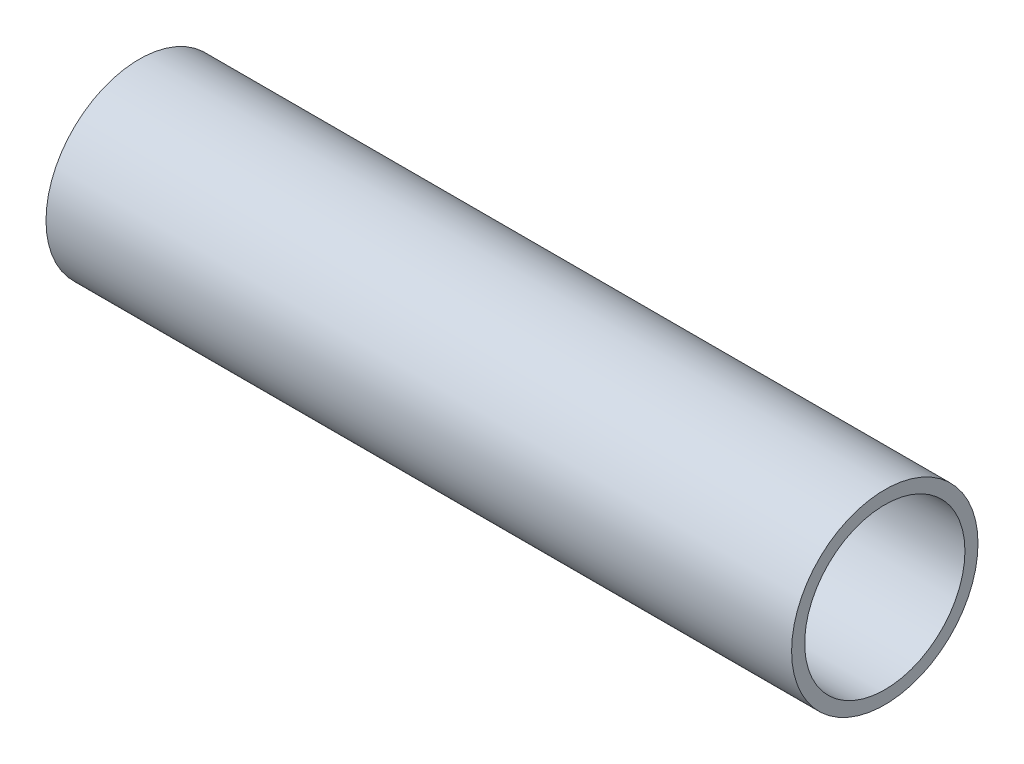
ISO-10303-21;
HEADER;
FILE_DESCRIPTION(('STEP AP214'),'2;1');
FILE_NAME('part.step','',(''),(''),'','','');
FILE_SCHEMA(('AUTOMOTIVE_DESIGN { 1 0 10303 214 1 1 1 1 }'));
ENDSEC;
DATA;
#1=APPLICATION_CONTEXT('core data for automotive mechanical design processes');
#2=APPLICATION_PROTOCOL_DEFINITION('international standard','automotive_design',2000,#1);
#3=PRODUCT_CONTEXT('',#1,'mechanical');
#4=PRODUCT('Part','Part','',(#3));
#5=PRODUCT_RELATED_PRODUCT_CATEGORY('part','',(#4));
#6=PRODUCT_DEFINITION_FORMATION('','',#4);
#7=PRODUCT_DEFINITION_CONTEXT('part definition',#1,'design');
#8=PRODUCT_DEFINITION('design','',#6,#7);
#9=PRODUCT_DEFINITION_SHAPE('','',#8);
#10=(LENGTH_UNIT() NAMED_UNIT(*) SI_UNIT(.MILLI.,.METRE.));
#11=(NAMED_UNIT(*) PLANE_ANGLE_UNIT() SI_UNIT($,.RADIAN.));
#12=(NAMED_UNIT(*) SI_UNIT($,.STERADIAN.) SOLID_ANGLE_UNIT());
#13=UNCERTAINTY_MEASURE_WITH_UNIT(LENGTH_MEASURE(1.E-05),#10,'distance_accuracy_value','');
#14=(GEOMETRIC_REPRESENTATION_CONTEXT(3) GLOBAL_UNCERTAINTY_ASSIGNED_CONTEXT((#13)) GLOBAL_UNIT_ASSIGNED_CONTEXT((#10,
#11,#12)) REPRESENTATION_CONTEXT('',''));
#15=CARTESIAN_POINT('',(0.,0.,0.));
#16=DIRECTION('',(0.,0.,1.));
#17=DIRECTION('',(1.,0.,0.));
#18=AXIS2_PLACEMENT_3D('',#15,#16,#17);
#19=CARTESIAN_POINT('',(50.8,0.,0.));
#20=DIRECTION('',(1.,0.,0.));
#21=DIRECTION('',(0.,0.,-1.));
#22=AXIS2_PLACEMENT_3D('',#19,#20,#21);
#23=PLANE('',#22);
#24=CARTESIAN_POINT('',(50.8,0.,0.));
#25=DIRECTION('',(1.,0.,0.));
#26=DIRECTION('',(0.,0.,-1.));
#27=AXIS2_PLACEMENT_3D('',#24,#25,#26);
#28=CIRCLE('',#27,6.35);
#29=CARTESIAN_POINT('',(50.8,0.,-6.35));
#30=VERTEX_POINT('',#29);
#31=EDGE_CURVE('E10',#30,#30,#28,.T.);
#32=ORIENTED_EDGE('',*,*,#31,.T.);
#33=EDGE_LOOP('',(#32));
#34=FACE_BOUND('',#33,.T.);
#35=CARTESIAN_POINT('',(50.8,0.,0.));
#36=DIRECTION('',(1.,0.,0.));
#37=DIRECTION('',(0.,0.,-1.));
#38=AXIS2_PLACEMENT_3D('',#35,#36,#37);
#39=CIRCLE('',#38,5.461);
#40=CARTESIAN_POINT('',(50.8,0.,-5.461));
#41=VERTEX_POINT('',#40);
#42=EDGE_CURVE('E50',#41,#41,#39,.T.);
#43=ORIENTED_EDGE('',*,*,#42,.F.);
#44=EDGE_LOOP('',(#43));
#45=FACE_BOUND('',#44,.T.);
#46=ADVANCED_FACE('F37',(#34,#45),#23,.T.);
#47=CARTESIAN_POINT('',(0.,0.,0.));
#48=DIRECTION('',(1.,0.,0.));
#49=DIRECTION('',(0.,0.,-1.));
#50=AXIS2_PLACEMENT_3D('',#47,#48,#49);
#51=PLANE('',#50);
#52=CARTESIAN_POINT('',(0.,0.,0.));
#53=DIRECTION('',(1.,0.,0.));
#54=DIRECTION('',(0.,0.,-1.));
#55=AXIS2_PLACEMENT_3D('',#52,#53,#54);
#56=CIRCLE('',#55,6.35);
#57=CARTESIAN_POINT('',(0.,0.,-6.35));
#58=VERTEX_POINT('',#57);
#59=EDGE_CURVE('E41',#58,#58,#56,.T.);
#60=ORIENTED_EDGE('',*,*,#59,.F.);
#61=EDGE_LOOP('',(#60));
#62=FACE_BOUND('',#61,.T.);
#63=CARTESIAN_POINT('',(0.,0.,0.));
#64=DIRECTION('',(1.,0.,0.));
#65=DIRECTION('',(0.,0.,-1.));
#66=AXIS2_PLACEMENT_3D('',#63,#64,#65);
#67=CIRCLE('',#66,5.461);
#68=CARTESIAN_POINT('',(0.,0.,-5.461));
#69=VERTEX_POINT('',#68);
#70=EDGE_CURVE('E52',#69,#69,#67,.T.);
#71=ORIENTED_EDGE('',*,*,#70,.T.);
#72=EDGE_LOOP('',(#71));
#73=FACE_BOUND('',#72,.T.);
#74=ADVANCED_FACE('F64',(#62,#73),#51,.F.);
#75=CARTESIAN_POINT('',(50.8,0.,0.));
#76=DIRECTION('',(-1.,0.,0.));
#77=DIRECTION('',(0.,0.,1.));
#78=AXIS2_PLACEMENT_3D('',#75,#76,#77);
#79=CYLINDRICAL_SURFACE('',#78,6.35);
#80=ORIENTED_EDGE('',*,*,#31,.F.);
#81=EDGE_LOOP('',(#80));
#82=FACE_BOUND('',#81,.T.);
#83=ORIENTED_EDGE('',*,*,#59,.T.);
#84=EDGE_LOOP('',(#83));
#85=FACE_BOUND('',#84,.T.);
#86=ADVANCED_FACE('F39',(#82,#85),#79,.T.);
#87=CARTESIAN_POINT('',(50.8,0.,0.));
#88=DIRECTION('',(-1.,0.,0.));
#89=DIRECTION('',(0.,0.,1.));
#90=AXIS2_PLACEMENT_3D('',#87,#88,#89);
#91=CYLINDRICAL_SURFACE('',#90,5.461);
#92=ORIENTED_EDGE('',*,*,#42,.T.);
#93=EDGE_LOOP('',(#92));
#94=FACE_BOUND('',#93,.T.);
#95=ORIENTED_EDGE('',*,*,#70,.F.);
#96=EDGE_LOOP('',(#95));
#97=FACE_BOUND('',#96,.T.);
#98=ADVANCED_FACE('F60',(#94,#97),#91,.F.);
#99=CLOSED_SHELL('',(#46,#74,#86,#98));
#100=MANIFOLD_SOLID_BREP('B2',#99);
#101=ADVANCED_BREP_SHAPE_REPRESENTATION('',(#18,#100),#14);
#102=SHAPE_DEFINITION_REPRESENTATION(#9,#101);
ENDSEC;
END-ISO-10303-21;
